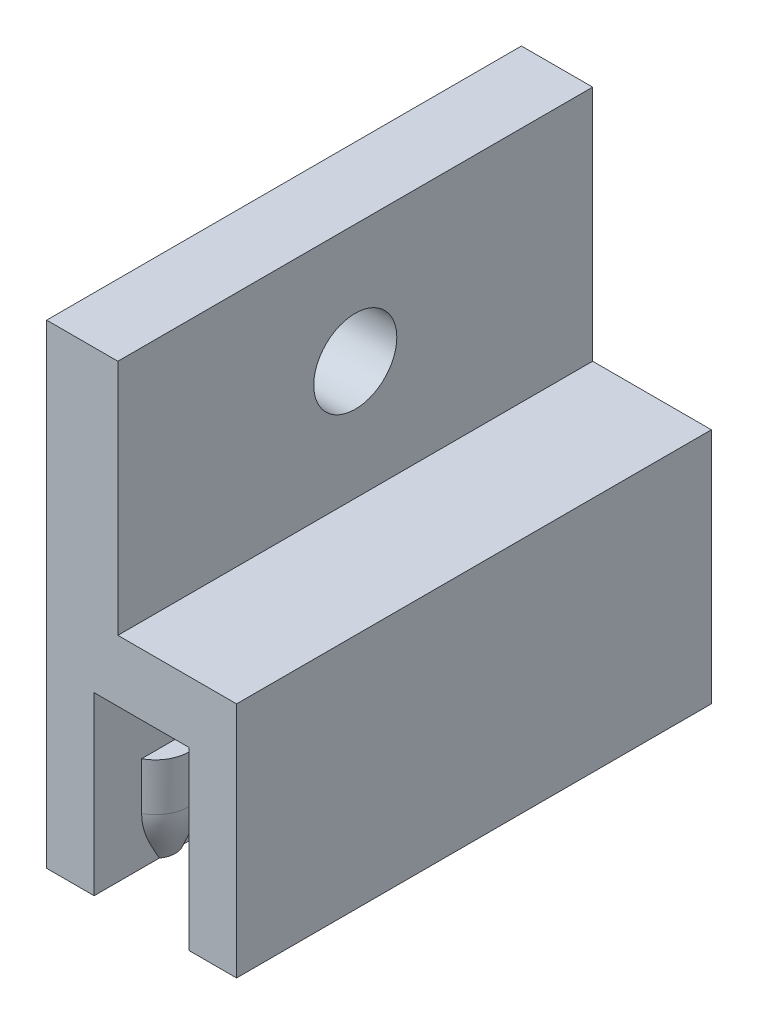
ISO-10303-21;
HEADER;
FILE_DESCRIPTION(('STEP AP214'),'2;1');
FILE_NAME('part.step','',(''),(''),'','','');
FILE_SCHEMA(('AUTOMOTIVE_DESIGN { 1 0 10303 214 1 1 1 1 }'));
ENDSEC;
DATA;
#1=APPLICATION_CONTEXT('core data for automotive mechanical design processes');
#2=APPLICATION_PROTOCOL_DEFINITION('international standard','automotive_design',2000,#1);
#3=PRODUCT_CONTEXT('',#1,'mechanical');
#4=PRODUCT('Part','Part','',(#3));
#5=PRODUCT_RELATED_PRODUCT_CATEGORY('part','',(#4));
#6=PRODUCT_DEFINITION_FORMATION('','',#4);
#7=PRODUCT_DEFINITION_CONTEXT('part definition',#1,'design');
#8=PRODUCT_DEFINITION('design','',#6,#7);
#9=PRODUCT_DEFINITION_SHAPE('','',#8);
#10=(LENGTH_UNIT() NAMED_UNIT(*) SI_UNIT(.MILLI.,.METRE.));
#11=(NAMED_UNIT(*) PLANE_ANGLE_UNIT() SI_UNIT($,.RADIAN.));
#12=(NAMED_UNIT(*) SI_UNIT($,.STERADIAN.) SOLID_ANGLE_UNIT());
#13=UNCERTAINTY_MEASURE_WITH_UNIT(LENGTH_MEASURE(1.E-05),#10,'distance_accuracy_value','');
#14=(GEOMETRIC_REPRESENTATION_CONTEXT(3) GLOBAL_UNCERTAINTY_ASSIGNED_CONTEXT((#13)) GLOBAL_UNIT_ASSIGNED_CONTEXT((#10,
#11,#12)) REPRESENTATION_CONTEXT('',''));
#15=CARTESIAN_POINT('',(0.,0.,0.));
#16=DIRECTION('',(0.,0.,1.));
#17=DIRECTION('',(1.,0.,0.));
#18=AXIS2_PLACEMENT_3D('',#15,#16,#17);
#19=CARTESIAN_POINT('',(0.,0.,20.));
#20=DIRECTION('',(-1.,0.,0.));
#21=DIRECTION('',(0.,0.,1.));
#22=AXIS2_PLACEMENT_3D('',#19,#20,#21);
#23=PLANE('',#22);
#24=DIRECTION('',(0.,1.,0.));
#25=VECTOR('',#24,1.);
#26=CARTESIAN_POINT('',(0.,0.,0.));
#27=LINE('',#26,#25);
#28=CARTESIAN_POINT('',(0.,0.,0.));
#29=VERTEX_POINT('',#28);
#30=CARTESIAN_POINT('',(0.,7.40971508067067,0.));
#31=VERTEX_POINT('',#30);
#32=EDGE_CURVE('E242',#29,#31,#27,.T.);
#33=ORIENTED_EDGE('',*,*,#32,.T.);
#34=CARTESIAN_POINT('',(0.,-77.,10.));
#35=DIRECTION('',(-1.,0.,0.));
#36=DIRECTION('',(0.,0.,1.));
#37=AXIS2_PLACEMENT_3D('',#34,#35,#36);
#38=CIRCLE('',#37,85.);
#39=CARTESIAN_POINT('',(0.,7.40971508067067,20.));
#40=VERTEX_POINT('',#39);
#41=EDGE_CURVE('E177',#40,#31,#38,.T.);
#42=ORIENTED_EDGE('',*,*,#41,.F.);
#43=DIRECTION('',(0.,1.,0.));
#44=VECTOR('',#43,1.);
#45=CARTESIAN_POINT('',(0.,0.,20.));
#46=LINE('',#45,#44);
#47=CARTESIAN_POINT('',(0.,0.,20.));
#48=VERTEX_POINT('',#47);
#49=EDGE_CURVE('E194',#48,#40,#46,.T.);
#50=ORIENTED_EDGE('',*,*,#49,.F.);
#51=DIRECTION('',(0.,0.,-1.));
#52=VECTOR('',#51,1.);
#53=CARTESIAN_POINT('',(0.,0.,20.));
#54=LINE('',#53,#52);
#55=CARTESIAN_POINT('',(0.,0.,17.25));
#56=VERTEX_POINT('',#55);
#57=EDGE_CURVE('E231',#48,#56,#54,.T.);
#58=ORIENTED_EDGE('',*,*,#57,.T.);
#59=CARTESIAN_POINT('',(0.,2.,18.));
#60=CARTESIAN_POINT('',(0.,1.28799968789021,18.));
#61=CARTESIAN_POINT('',(0.,0.643999843945103,17.625));
#62=CARTESIAN_POINT('',(0.,0.,17.25));
#63=B_SPLINE_CURVE_WITH_KNOTS('',3,(#59,#60,#61,#62),.UNSPECIFIED.,.F.,.F.,(4,4),(0.,1.),.UNSPECIFIED.);
#64=CARTESIAN_POINT('',(0.,2.,18.));
#65=VERTEX_POINT('',#64);
#66=EDGE_CURVE('E336',#65,#56,#63,.T.);
#67=ORIENTED_EDGE('',*,*,#66,.F.);
#68=DIRECTION('',(0.,-1.,0.));
#69=VECTOR('',#68,1.);
#70=CARTESIAN_POINT('',(0.,4.,18.));
#71=LINE('',#70,#69);
#72=CARTESIAN_POINT('',(0.,4.,18.));
#73=VERTEX_POINT('',#72);
#74=EDGE_CURVE('E253',#73,#65,#71,.T.);
#75=ORIENTED_EDGE('',*,*,#74,.F.);
#76=DIRECTION('',(0.,0.,-1.));
#77=VECTOR('',#76,1.);
#78=CARTESIAN_POINT('',(0.,4.,18.));
#79=LINE('',#78,#77);
#80=CARTESIAN_POINT('',(0.,4.,15.5));
#81=VERTEX_POINT('',#80);
#82=EDGE_CURVE('E257',#73,#81,#79,.T.);
#83=ORIENTED_EDGE('',*,*,#82,.T.);
#84=DIRECTION('',(0.,-1.,0.));
#85=VECTOR('',#84,1.);
#86=CARTESIAN_POINT('',(0.,4.,15.5));
#87=LINE('',#86,#85);
#88=CARTESIAN_POINT('',(0.,2.,15.5));
#89=VERTEX_POINT('',#88);
#90=EDGE_CURVE('E256',#81,#89,#87,.T.);
#91=ORIENTED_EDGE('',*,*,#90,.T.);
#92=CARTESIAN_POINT('',(0.,0.,16.25));
#93=CARTESIAN_POINT('',(0.,0.643999843945103,15.875));
#94=CARTESIAN_POINT('',(0.,1.28799968789021,15.5));
#95=CARTESIAN_POINT('',(0.,2.,15.5));
#96=B_SPLINE_CURVE_WITH_KNOTS('',3,(#92,#93,#94,#95),.UNSPECIFIED.,.F.,.F.,(4,4),(0.,1.),.UNSPECIFIED.);
#97=CARTESIAN_POINT('',(0.,0.,16.25));
#98=VERTEX_POINT('',#97);
#99=EDGE_CURVE('E338',#98,#89,#96,.T.);
#100=ORIENTED_EDGE('',*,*,#99,.F.);
#101=CARTESIAN_POINT('',(0.,0.,3.75));
#102=VERTEX_POINT('',#101);
#103=EDGE_CURVE('E226',#98,#102,#54,.T.);
#104=ORIENTED_EDGE('',*,*,#103,.T.);
#105=CARTESIAN_POINT('',(0.,2.,4.5));
#106=CARTESIAN_POINT('',(0.,1.28799968789021,4.5));
#107=CARTESIAN_POINT('',(0.,0.643999843945103,4.125));
#108=CARTESIAN_POINT('',(0.,0.,3.75));
#109=B_SPLINE_CURVE_WITH_KNOTS('',3,(#105,#106,#107,#108),.UNSPECIFIED.,.F.,.F.,(4,4),(0.,1.),.UNSPECIFIED.);
#110=CARTESIAN_POINT('',(0.,2.,4.5));
#111=VERTEX_POINT('',#110);
#112=EDGE_CURVE('E170',#111,#102,#109,.T.);
#113=ORIENTED_EDGE('',*,*,#112,.F.);
#114=DIRECTION('',(0.,-1.,0.));
#115=VECTOR('',#114,1.);
#116=CARTESIAN_POINT('',(0.,4.,4.5));
#117=LINE('',#116,#115);
#118=CARTESIAN_POINT('',(0.,4.,4.5));
#119=VERTEX_POINT('',#118);
#120=EDGE_CURVE('E405',#119,#111,#117,.T.);
#121=ORIENTED_EDGE('',*,*,#120,.F.);
#122=DIRECTION('',(0.,0.,-1.));
#123=VECTOR('',#122,1.);
#124=CARTESIAN_POINT('',(0.,4.,2.));
#125=LINE('',#124,#123);
#126=CARTESIAN_POINT('',(0.,4.,2.));
#127=VERTEX_POINT('',#126);
#128=EDGE_CURVE('E402',#119,#127,#125,.T.);
#129=ORIENTED_EDGE('',*,*,#128,.T.);
#130=DIRECTION('',(0.,-1.,0.));
#131=VECTOR('',#130,1.);
#132=CARTESIAN_POINT('',(0.,4.,2.));
#133=LINE('',#132,#131);
#134=CARTESIAN_POINT('',(0.,2.,2.));
#135=VERTEX_POINT('',#134);
#136=EDGE_CURVE('E500',#127,#135,#133,.T.);
#137=ORIENTED_EDGE('',*,*,#136,.T.);
#138=CARTESIAN_POINT('',(0.,0.,2.75));
#139=CARTESIAN_POINT('',(0.,0.643999843945103,2.375));
#140=CARTESIAN_POINT('',(0.,1.28799968789021,2.));
#141=CARTESIAN_POINT('',(0.,2.,2.));
#142=B_SPLINE_CURVE_WITH_KNOTS('',3,(#138,#139,#140,#141),.UNSPECIFIED.,.F.,.F.,(4,4),(0.,1.),.UNSPECIFIED.);
#143=CARTESIAN_POINT('',(0.,0.,2.75));
#144=VERTEX_POINT('',#143);
#145=EDGE_CURVE('E337',#144,#135,#142,.T.);
#146=ORIENTED_EDGE('',*,*,#145,.F.);
#147=EDGE_CURVE('E223',#144,#29,#54,.T.);
#148=ORIENTED_EDGE('',*,*,#147,.T.);
#149=EDGE_LOOP('',(#33,#42,#50,#58,#67,#75,#83,#91,#100,#104,#113,#121,#129,#137,#146,#148));
#150=FACE_BOUND('',#149,.T.);
#151=ADVANCED_FACE('F44',(#150),#23,.F.);
#152=CARTESIAN_POINT('',(4.,8.,20.));
#153=DIRECTION('',(1.,0.,0.));
#154=DIRECTION('',(0.,1.,0.));
#155=AXIS2_PLACEMENT_3D('',#152,#153,#154);
#156=PLANE('',#155);
#157=CARTESIAN_POINT('',(4.0000000000191,-77.,10.));
#158=DIRECTION('',(1.,0.,0.));
#159=DIRECTION('',(0.,1.,0.));
#160=AXIS2_PLACEMENT_3D('',#157,#158,#159);
#161=CIRCLE('',#160,85.);
#162=CARTESIAN_POINT('',(4.00000000013279,7.40971508067067,20.));
#163=VERTEX_POINT('',#162);
#164=CARTESIAN_POINT('',(4.00000000013279,7.40971508067067,0.));
#165=VERTEX_POINT('',#164);
#166=EDGE_CURVE('E162',#163,#165,#161,.F.);
#167=ORIENTED_EDGE('',*,*,#166,.T.);
#168=DIRECTION('',(0.,-1.,0.));
#169=VECTOR('',#168,1.);
#170=CARTESIAN_POINT('',(4.,8.,0.));
#171=LINE('',#170,#169);
#172=CARTESIAN_POINT('',(4.,0.,0.));
#173=VERTEX_POINT('',#172);
#174=EDGE_CURVE('E166',#165,#173,#171,.T.);
#175=ORIENTED_EDGE('',*,*,#174,.T.);
#176=DIRECTION('',(0.,0.,-1.));
#177=VECTOR('',#176,1.);
#178=CARTESIAN_POINT('',(4.,0.,20.));
#179=LINE('',#178,#177);
#180=CARTESIAN_POINT('',(4.,0.,20.));
#181=VERTEX_POINT('',#180);
#182=EDGE_CURVE('E12',#181,#173,#179,.T.);
#183=ORIENTED_EDGE('',*,*,#182,.F.);
#184=DIRECTION('',(0.,-1.,0.));
#185=VECTOR('',#184,1.);
#186=CARTESIAN_POINT('',(4.,8.,20.));
#187=LINE('',#186,#185);
#188=EDGE_CURVE('E167',#163,#181,#187,.T.);
#189=ORIENTED_EDGE('',*,*,#188,.F.);
#190=EDGE_LOOP('',(#167,#175,#183,#189));
#191=FACE_BOUND('',#190,.T.);
#192=ADVANCED_FACE('F46',(#191),#156,.F.);
#193=CARTESIAN_POINT('',(6.,0.,20.));
#194=DIRECTION('',(0.,-1.,0.));
#195=DIRECTION('',(0.,0.,-1.));
#196=AXIS2_PLACEMENT_3D('',#193,#194,#195);
#197=PLANE('',#196);
#198=DIRECTION('',(-1.,0.,0.));
#199=VECTOR('',#198,1.);
#200=CARTESIAN_POINT('',(6.,0.,0.));
#201=LINE('',#200,#199);
#202=CARTESIAN_POINT('',(6.,0.,0.));
#203=VERTEX_POINT('',#202);
#204=EDGE_CURVE('E186',#203,#173,#201,.T.);
#205=ORIENTED_EDGE('',*,*,#204,.F.);
#206=DIRECTION('',(0.,0.,-1.));
#207=VECTOR('',#206,1.);
#208=CARTESIAN_POINT('',(6.,0.,20.));
#209=LINE('',#208,#207);
#210=CARTESIAN_POINT('',(6.,0.,20.));
#211=VERTEX_POINT('',#210);
#212=EDGE_CURVE('E55',#211,#203,#209,.T.);
#213=ORIENTED_EDGE('',*,*,#212,.F.);
#214=DIRECTION('',(-1.,0.,0.));
#215=VECTOR('',#214,1.);
#216=CARTESIAN_POINT('',(6.,0.,20.));
#217=LINE('',#216,#215);
#218=EDGE_CURVE('E367',#211,#181,#217,.T.);
#219=ORIENTED_EDGE('',*,*,#218,.T.);
#220=ORIENTED_EDGE('',*,*,#182,.T.);
#221=EDGE_LOOP('',(#205,#213,#219,#220));
#222=FACE_BOUND('',#221,.T.);
#223=ADVANCED_FACE('F381',(#222),#197,.T.);
#224=CARTESIAN_POINT('',(6.,8.,20.));
#225=DIRECTION('',(1.,0.,0.));
#226=DIRECTION('',(0.,1.,0.));
#227=AXIS2_PLACEMENT_3D('',#224,#225,#226);
#228=PLANE('',#227);
#229=DIRECTION('',(0.,-1.,0.));
#230=VECTOR('',#229,1.);
#231=CARTESIAN_POINT('',(6.,8.,0.));
#232=LINE('',#231,#230);
#233=CARTESIAN_POINT('',(6.,10.,0.));
#234=VERTEX_POINT('',#233);
#235=EDGE_CURVE('E189',#234,#203,#232,.T.);
#236=ORIENTED_EDGE('',*,*,#235,.F.);
#237=DIRECTION('',(0.,0.,-1.));
#238=VECTOR('',#237,1.);
#239=CARTESIAN_POINT('',(6.,10.,20.));
#240=LINE('',#239,#238);
#241=CARTESIAN_POINT('',(6.,10.,20.));
#242=VERTEX_POINT('',#241);
#243=EDGE_CURVE('E378',#242,#234,#240,.T.);
#244=ORIENTED_EDGE('',*,*,#243,.F.);
#245=DIRECTION('',(0.,-1.,0.));
#246=VECTOR('',#245,1.);
#247=CARTESIAN_POINT('',(6.,8.,20.));
#248=LINE('',#247,#246);
#249=EDGE_CURVE('E210',#242,#211,#248,.T.);
#250=ORIENTED_EDGE('',*,*,#249,.T.);
#251=ORIENTED_EDGE('',*,*,#212,.T.);
#252=EDGE_LOOP('',(#236,#244,#250,#251));
#253=FACE_BOUND('',#252,.T.);
#254=ADVANCED_FACE('F376',(#253),#228,.T.);
#255=CARTESIAN_POINT('',(0.,10.,20.));
#256=DIRECTION('',(0.,1.,0.));
#257=DIRECTION('',(0.,0.,1.));
#258=AXIS2_PLACEMENT_3D('',#255,#256,#257);
#259=PLANE('',#258);
#260=DIRECTION('',(0.,0.,-1.));
#261=VECTOR('',#260,1.);
#262=CARTESIAN_POINT('',(1.,10.,20.));
#263=LINE('',#262,#261);
#264=CARTESIAN_POINT('',(1.,10.,20.));
#265=VERTEX_POINT('',#264);
#266=CARTESIAN_POINT('',(1.,10.,0.));
#267=VERTEX_POINT('',#266);
#268=EDGE_CURVE('E211',#265,#267,#263,.T.);
#269=ORIENTED_EDGE('',*,*,#268,.F.);
#270=DIRECTION('',(1.,0.,0.));
#271=VECTOR('',#270,1.);
#272=CARTESIAN_POINT('',(0.,10.,20.));
#273=LINE('',#272,#271);
#274=EDGE_CURVE('E206',#265,#242,#273,.T.);
#275=ORIENTED_EDGE('',*,*,#274,.T.);
#276=ORIENTED_EDGE('',*,*,#243,.T.);
#277=DIRECTION('',(1.,0.,0.));
#278=VECTOR('',#277,1.);
#279=CARTESIAN_POINT('',(0.,10.,0.));
#280=LINE('',#279,#278);
#281=EDGE_CURVE('E198',#267,#234,#280,.T.);
#282=ORIENTED_EDGE('',*,*,#281,.F.);
#283=EDGE_LOOP('',(#269,#275,#276,#282));
#284=FACE_BOUND('',#283,.T.);
#285=ADVANCED_FACE('F386',(#284),#259,.T.);
#286=CARTESIAN_POINT('',(-2.,0.,20.));
#287=DIRECTION('',(-1.,0.,0.));
#288=DIRECTION('',(0.,0.,1.));
#289=AXIS2_PLACEMENT_3D('',#286,#287,#288);
#290=PLANE('',#289);
#291=CARTESIAN_POINT('',(-2.,15.,10.));
#292=DIRECTION('',(1.,0.,0.));
#293=DIRECTION('',(0.,0.,-1.));
#294=AXIS2_PLACEMENT_3D('',#291,#292,#293);
#295=CIRCLE('',#294,1.75);
#296=CARTESIAN_POINT('',(-2.,15.,8.25));
#297=VERTEX_POINT('',#296);
#298=EDGE_CURVE('E391',#297,#297,#295,.T.);
#299=ORIENTED_EDGE('',*,*,#298,.T.);
#300=EDGE_LOOP('',(#299));
#301=FACE_BOUND('',#300,.T.);
#302=DIRECTION('',(0.,1.,0.));
#303=VECTOR('',#302,1.);
#304=CARTESIAN_POINT('',(-2.,0.,0.));
#305=LINE('',#304,#303);
#306=CARTESIAN_POINT('',(-2.,0.,0.));
#307=VERTEX_POINT('',#306);
#308=CARTESIAN_POINT('',(-2.,20.,0.));
#309=VERTEX_POINT('',#308);
#310=EDGE_CURVE('E201',#307,#309,#305,.T.);
#311=ORIENTED_EDGE('',*,*,#310,.F.);
#312=DIRECTION('',(0.,0.,-1.));
#313=VECTOR('',#312,1.);
#314=CARTESIAN_POINT('',(-2.,0.,20.));
#315=LINE('',#314,#313);
#316=CARTESIAN_POINT('',(-2.,0.,20.));
#317=VERTEX_POINT('',#316);
#318=EDGE_CURVE('E243',#317,#307,#315,.T.);
#319=ORIENTED_EDGE('',*,*,#318,.F.);
#320=DIRECTION('',(0.,1.,0.));
#321=VECTOR('',#320,1.);
#322=CARTESIAN_POINT('',(-2.,0.,20.));
#323=LINE('',#322,#321);
#324=CARTESIAN_POINT('',(-2.,20.,20.));
#325=VERTEX_POINT('',#324);
#326=EDGE_CURVE('E209',#317,#325,#323,.T.);
#327=ORIENTED_EDGE('',*,*,#326,.T.);
#328=DIRECTION('',(0.,0.,-1.));
#329=VECTOR('',#328,1.);
#330=CARTESIAN_POINT('',(-2.,20.,20.));
#331=LINE('',#330,#329);
#332=EDGE_CURVE('E191',#325,#309,#331,.T.);
#333=ORIENTED_EDGE('',*,*,#332,.T.);
#334=EDGE_LOOP('',(#311,#319,#327,#333));
#335=FACE_BOUND('',#334,.T.);
#336=ADVANCED_FACE('F358',(#301,#335),#290,.T.);
#337=CARTESIAN_POINT('',(0.,0.,20.));
#338=DIRECTION('',(0.,-1.,0.));
#339=DIRECTION('',(0.,0.,-1.));
#340=AXIS2_PLACEMENT_3D('',#337,#338,#339);
#341=PLANE('',#340);
#342=DIRECTION('',(-1.,0.,0.));
#343=VECTOR('',#342,1.);
#344=CARTESIAN_POINT('',(0.,0.,0.));
#345=LINE('',#344,#343);
#346=EDGE_CURVE('E388',#29,#307,#345,.T.);
#347=ORIENTED_EDGE('',*,*,#346,.F.);
#348=ORIENTED_EDGE('',*,*,#147,.F.);
#349=CARTESIAN_POINT('',(0.,0.,3.75));
#350=CARTESIAN_POINT('',(0.111076570808846,0.,3.60189790558821));
#351=CARTESIAN_POINT('',(0.166614856213268,0.,3.4259489527941));
#352=CARTESIAN_POINT('',(0.166614856213268,0.,3.0740510472059));
#353=CARTESIAN_POINT('',(0.111076570808846,0.,2.89810209441179));
#354=CARTESIAN_POINT('',(0.,0.,2.75));
#355=B_SPLINE_CURVE_WITH_KNOTS('',3,(#349,#350,#351,#352,#353,#354),.UNSPECIFIED.,.F.,.F.,(4,2,
4),(0.,0.5,1.),.UNSPECIFIED.);
#356=EDGE_CURVE('E63',#144,#102,#355,.F.);
#357=ORIENTED_EDGE('',*,*,#356,.T.);
#358=ORIENTED_EDGE('',*,*,#103,.F.);
#359=CARTESIAN_POINT('',(0.,0.,17.25));
#360=CARTESIAN_POINT('',(0.111076570808846,0.,17.1018979055882));
#361=CARTESIAN_POINT('',(0.166614856213268,0.,16.9259489527941));
#362=CARTESIAN_POINT('',(0.166614856213268,0.,16.5740510472059));
#363=CARTESIAN_POINT('',(0.111076570808846,0.,16.3981020944118));
#364=CARTESIAN_POINT('',(0.,0.,16.25));
#365=B_SPLINE_CURVE_WITH_KNOTS('',3,(#359,#360,#361,#362,#363,#364),.UNSPECIFIED.,.F.,.F.,(4,2,
4),(0.,0.5,1.),.UNSPECIFIED.);
#366=EDGE_CURVE('E72',#98,#56,#365,.F.);
#367=ORIENTED_EDGE('',*,*,#366,.T.);
#368=ORIENTED_EDGE('',*,*,#57,.F.);
#369=DIRECTION('',(-1.,0.,0.));
#370=VECTOR('',#369,1.);
#371=CARTESIAN_POINT('',(0.,0.,20.));
#372=LINE('',#371,#370);
#373=EDGE_CURVE('E218',#48,#317,#372,.T.);
#374=ORIENTED_EDGE('',*,*,#373,.T.);
#375=ORIENTED_EDGE('',*,*,#318,.T.);
#376=EDGE_LOOP('',(#347,#348,#357,#358,#367,#368,#374,#375));
#377=FACE_BOUND('',#376,.T.);
#378=ADVANCED_FACE('F297',(#377),#341,.T.);
#379=CARTESIAN_POINT('',(4.,0.,20.));
#380=DIRECTION('',(0.,0.,-1.));
#381=DIRECTION('',(-1.,0.,0.));
#382=AXIS2_PLACEMENT_3D('',#379,#380,#381);
#383=PLANE('',#382);
#384=DIRECTION('',(-1.,0.,0.));
#385=VECTOR('',#384,1.);
#386=CARTESIAN_POINT('',(500000.,7.40971508067067,20.));
#387=LINE('',#386,#385);
#388=EDGE_CURVE('E171',#163,#40,#387,.T.);
#389=ORIENTED_EDGE('',*,*,#388,.F.);
#390=ORIENTED_EDGE('',*,*,#188,.T.);
#391=ORIENTED_EDGE('',*,*,#218,.F.);
#392=ORIENTED_EDGE('',*,*,#249,.F.);
#393=ORIENTED_EDGE('',*,*,#274,.F.);
#394=DIRECTION('',(0.,1.,0.));
#395=VECTOR('',#394,1.);
#396=CARTESIAN_POINT('',(1.,10.,20.));
#397=LINE('',#396,#395);
#398=CARTESIAN_POINT('',(1.,20.,20.));
#399=VERTEX_POINT('',#398);
#400=EDGE_CURVE('E389',#265,#399,#397,.T.);
#401=ORIENTED_EDGE('',*,*,#400,.T.);
#402=DIRECTION('',(1.,0.,0.));
#403=VECTOR('',#402,1.);
#404=CARTESIAN_POINT('',(-2.,20.,20.));
#405=LINE('',#404,#403);
#406=EDGE_CURVE('E353',#325,#399,#405,.T.);
#407=ORIENTED_EDGE('',*,*,#406,.F.);
#408=ORIENTED_EDGE('',*,*,#326,.F.);
#409=ORIENTED_EDGE('',*,*,#373,.F.);
#410=ORIENTED_EDGE('',*,*,#49,.T.);
#411=EDGE_LOOP('',(#389,#390,#391,#392,#393,#401,#407,#408,#409,#410));
#412=FACE_BOUND('',#411,.T.);
#413=ADVANCED_FACE('F294',(#412),#383,.F.);
#414=CARTESIAN_POINT('',(4.,0.,0.));
#415=DIRECTION('',(0.,0.,-1.));
#416=DIRECTION('',(-1.,0.,0.));
#417=AXIS2_PLACEMENT_3D('',#414,#415,#416);
#418=PLANE('',#417);
#419=ORIENTED_EDGE('',*,*,#174,.F.);
#420=DIRECTION('',(-1.,0.,0.));
#421=VECTOR('',#420,1.);
#422=CARTESIAN_POINT('',(500000.,7.40971508067067,0.));
#423=LINE('',#422,#421);
#424=EDGE_CURVE('E174',#165,#31,#423,.T.);
#425=ORIENTED_EDGE('',*,*,#424,.T.);
#426=ORIENTED_EDGE('',*,*,#32,.F.);
#427=ORIENTED_EDGE('',*,*,#346,.T.);
#428=ORIENTED_EDGE('',*,*,#310,.T.);
#429=DIRECTION('',(1.,0.,0.));
#430=VECTOR('',#429,1.);
#431=CARTESIAN_POINT('',(-2.,20.,0.));
#432=LINE('',#431,#430);
#433=CARTESIAN_POINT('',(1.,20.,0.));
#434=VERTEX_POINT('',#433);
#435=EDGE_CURVE('E361',#309,#434,#432,.T.);
#436=ORIENTED_EDGE('',*,*,#435,.T.);
#437=DIRECTION('',(0.,1.,0.));
#438=VECTOR('',#437,1.);
#439=CARTESIAN_POINT('',(1.,10.,0.));
#440=LINE('',#439,#438);
#441=EDGE_CURVE('E384',#267,#434,#440,.T.);
#442=ORIENTED_EDGE('',*,*,#441,.F.);
#443=ORIENTED_EDGE('',*,*,#281,.T.);
#444=ORIENTED_EDGE('',*,*,#235,.T.);
#445=ORIENTED_EDGE('',*,*,#204,.T.);
#446=EDGE_LOOP('',(#419,#425,#426,#427,#428,#436,#442,#443,#444,#445));
#447=FACE_BOUND('',#446,.T.);
#448=ADVANCED_FACE('F183',(#447),#418,.T.);
#449=CARTESIAN_POINT('',(1.,10.,20.));
#450=DIRECTION('',(-1.,0.,0.));
#451=DIRECTION('',(0.,0.,1.));
#452=AXIS2_PLACEMENT_3D('',#449,#450,#451);
#453=PLANE('',#452);
#454=CARTESIAN_POINT('',(1.,15.,10.));
#455=DIRECTION('',(1.,0.,0.));
#456=DIRECTION('',(0.,0.,-1.));
#457=AXIS2_PLACEMENT_3D('',#454,#455,#456);
#458=CIRCLE('',#457,1.75);
#459=CARTESIAN_POINT('',(1.,15.,8.25));
#460=VERTEX_POINT('',#459);
#461=EDGE_CURVE('E262',#460,#460,#458,.T.);
#462=ORIENTED_EDGE('',*,*,#461,.F.);
#463=EDGE_LOOP('',(#462));
#464=FACE_BOUND('',#463,.T.);
#465=ORIENTED_EDGE('',*,*,#441,.T.);
#466=DIRECTION('',(0.,0.,-1.));
#467=VECTOR('',#466,1.);
#468=CARTESIAN_POINT('',(1.,20.,20.));
#469=LINE('',#468,#467);
#470=EDGE_CURVE('E187',#399,#434,#469,.T.);
#471=ORIENTED_EDGE('',*,*,#470,.F.);
#472=ORIENTED_EDGE('',*,*,#400,.F.);
#473=ORIENTED_EDGE('',*,*,#268,.T.);
#474=EDGE_LOOP('',(#465,#471,#472,#473));
#475=FACE_BOUND('',#474,.T.);
#476=ADVANCED_FACE('F289',(#464,#475),#453,.F.);
#477=CARTESIAN_POINT('',(-2.,20.,20.));
#478=DIRECTION('',(0.,1.,0.));
#479=DIRECTION('',(0.,0.,1.));
#480=AXIS2_PLACEMENT_3D('',#477,#478,#479);
#481=PLANE('',#480);
#482=ORIENTED_EDGE('',*,*,#435,.F.);
#483=ORIENTED_EDGE('',*,*,#332,.F.);
#484=ORIENTED_EDGE('',*,*,#406,.T.);
#485=ORIENTED_EDGE('',*,*,#470,.T.);
#486=EDGE_LOOP('',(#482,#483,#484,#485));
#487=FACE_BOUND('',#486,.T.);
#488=ADVANCED_FACE('F285',(#487),#481,.T.);
#489=CARTESIAN_POINT('',(-2.,15.,10.));
#490=DIRECTION('',(1.,0.,0.));
#491=DIRECTION('',(0.,0.,-1.));
#492=AXIS2_PLACEMENT_3D('',#489,#490,#491);
#493=CYLINDRICAL_SURFACE('',#492,1.75);
#494=ORIENTED_EDGE('',*,*,#298,.F.);
#495=EDGE_LOOP('',(#494));
#496=FACE_BOUND('',#495,.T.);
#497=ORIENTED_EDGE('',*,*,#461,.T.);
#498=EDGE_LOOP('',(#497));
#499=FACE_BOUND('',#498,.T.);
#500=ADVANCED_FACE('F280',(#496,#499),#493,.F.);
#501=CARTESIAN_POINT('',(-0.666666666666666,4.,16.75));
#502=DIRECTION('',(0.,-1.,0.));
#503=DIRECTION('',(0.,0.,-1.));
#504=AXIS2_PLACEMENT_3D('',#501,#502,#503);
#505=CYLINDRICAL_SURFACE('',#504,1.41666666666667);
#506=CARTESIAN_POINT('',(0.,2.,15.5));
#507=CARTESIAN_POINT('',(0.461566259649048,2.,15.7461686718128));
#508=CARTESIAN_POINT('',(0.75,2.,16.2268915723977));
#509=CARTESIAN_POINT('',(0.750000000000001,2.,17.2731084276023));
#510=CARTESIAN_POINT('',(0.461566259649049,2.,17.7538313281872));
#511=CARTESIAN_POINT('',(0.,2.,18.));
#512=B_SPLINE_CURVE_WITH_KNOTS('',3,(#506,#507,#508,#509,#510,#511),.UNSPECIFIED.,.F.,.F.,(4,2,
4),(0.,0.5,1.),.UNSPECIFIED.);
#513=EDGE_CURVE('E345',#89,#65,#512,.T.);
#514=ORIENTED_EDGE('',*,*,#513,.F.);
#515=ORIENTED_EDGE('',*,*,#90,.F.);
#516=CARTESIAN_POINT('',(-0.666666666666666,4.,16.75));
#517=DIRECTION('',(0.,-1.,0.));
#518=DIRECTION('',(0.,0.,1.));
#519=AXIS2_PLACEMENT_3D('',#516,#517,#518);
#520=CIRCLE('',#519,1.41666666666667);
#521=EDGE_CURVE('E399',#81,#73,#520,.T.);
#522=ORIENTED_EDGE('',*,*,#521,.T.);
#523=ORIENTED_EDGE('',*,*,#74,.T.);
#524=EDGE_LOOP('',(#514,#515,#522,#523));
#525=FACE_BOUND('',#524,.T.);
#526=ADVANCED_FACE('F269',(#525),#505,.T.);
#527=CARTESIAN_POINT('',(-0.666666666666666,4.,16.75));
#528=DIRECTION('',(0.,1.,0.));
#529=DIRECTION('',(0.,0.,1.));
#530=AXIS2_PLACEMENT_3D('',#527,#528,#529);
#531=PLANE('',#530);
#532=ORIENTED_EDGE('',*,*,#521,.F.);
#533=ORIENTED_EDGE('',*,*,#82,.F.);
#534=EDGE_LOOP('',(#532,#533));
#535=FACE_BOUND('',#534,.T.);
#536=ADVANCED_FACE('F279',(#535),#531,.T.);
#537=CARTESIAN_POINT('',(-0.666666666666666,4.,3.25));
#538=DIRECTION('',(0.,-1.,0.));
#539=DIRECTION('',(0.,0.,-1.));
#540=AXIS2_PLACEMENT_3D('',#537,#538,#539);
#541=CYLINDRICAL_SURFACE('',#540,1.41666666666667);
#542=CARTESIAN_POINT('',(0.,2.,2.));
#543=CARTESIAN_POINT('',(0.461566259649048,2.,2.24616867181282));
#544=CARTESIAN_POINT('',(0.75,2.,2.72689157239774));
#545=CARTESIAN_POINT('',(0.750000000000001,2.,3.77310842760225));
#546=CARTESIAN_POINT('',(0.461566259649049,2.,4.25383132818717));
#547=CARTESIAN_POINT('',(0.,2.,4.5));
#548=B_SPLINE_CURVE_WITH_KNOTS('',3,(#542,#543,#544,#545,#546,#547),.UNSPECIFIED.,.F.,.F.,(4,2,
4),(0.,0.5,1.),.UNSPECIFIED.);
#549=EDGE_CURVE('E341',#135,#111,#548,.T.);
#550=ORIENTED_EDGE('',*,*,#549,.F.);
#551=ORIENTED_EDGE('',*,*,#136,.F.);
#552=CARTESIAN_POINT('',(-0.666666666666666,4.,3.25));
#553=DIRECTION('',(0.,-1.,0.));
#554=DIRECTION('',(0.,0.,-1.));
#555=AXIS2_PLACEMENT_3D('',#552,#553,#554);
#556=CIRCLE('',#555,1.41666666666667);
#557=EDGE_CURVE('E406',#127,#119,#556,.T.);
#558=ORIENTED_EDGE('',*,*,#557,.T.);
#559=ORIENTED_EDGE('',*,*,#120,.T.);
#560=EDGE_LOOP('',(#550,#551,#558,#559));
#561=FACE_BOUND('',#560,.T.);
#562=ADVANCED_FACE('F499',(#561),#541,.T.);
#563=CARTESIAN_POINT('',(-0.666666666666666,4.,3.25));
#564=DIRECTION('',(0.,-1.,0.));
#565=DIRECTION('',(0.,0.,-1.));
#566=AXIS2_PLACEMENT_3D('',#563,#564,#565);
#567=PLANE('',#566);
#568=ORIENTED_EDGE('',*,*,#557,.F.);
#569=ORIENTED_EDGE('',*,*,#128,.F.);
#570=EDGE_LOOP('',(#568,#569));
#571=FACE_BOUND('',#570,.T.);
#572=ADVANCED_FACE('F422',(#571),#567,.F.);
#573=CARTESIAN_POINT('',(0.,0.,17.25));
#574=CARTESIAN_POINT('',(0.,0.643999843945103,17.625));
#575=CARTESIAN_POINT('',(0.,1.28799968789021,18.));
#576=CARTESIAN_POINT('',(0.,2.,18.));
#577=CARTESIAN_POINT('',(0.111076570808846,0.,17.1018979055882));
#578=CARTESIAN_POINT('',(0.286321415228947,0.648387601901384,17.4278646168877));
#579=CARTESIAN_POINT('',(0.461566259649049,1.29677520380277,17.7538313281872));
#580=CARTESIAN_POINT('',(0.461566259649049,2.,17.7538313281872));
#581=CARTESIAN_POINT('',(0.166614856213268,0.,16.9259489527941));
#582=CARTESIAN_POINT('',(0.458307428106635,0.652775359857665,17.0995286901982));
#583=CARTESIAN_POINT('',(0.750000000000001,1.30555071971533,17.2731084276023));
#584=CARTESIAN_POINT('',(0.750000000000001,2.,17.2731084276023));
#585=CARTESIAN_POINT('',(0.166614856213268,0.,16.5740510472059));
#586=CARTESIAN_POINT('',(0.458307428106634,0.652775359857665,16.4004713098018));
#587=CARTESIAN_POINT('',(0.75,1.30555071971533,16.2268915723977));
#588=CARTESIAN_POINT('',(0.75,2.,16.2268915723977));
#589=CARTESIAN_POINT('',(0.111076570808846,0.,16.3981020944118));
#590=CARTESIAN_POINT('',(0.286321415228947,0.648387601901384,16.0721353831123));
#591=CARTESIAN_POINT('',(0.461566259649048,1.29677520380277,15.7461686718128));
#592=CARTESIAN_POINT('',(0.461566259649048,2.,15.7461686718128));
#593=CARTESIAN_POINT('',(0.,0.,16.25));
#594=CARTESIAN_POINT('',(0.,0.643999843945103,15.875));
#595=CARTESIAN_POINT('',(0.,1.28799968789021,15.5));
#596=CARTESIAN_POINT('',(0.,2.,15.5));
#597=B_SPLINE_SURFACE_WITH_KNOTS('',3,3,((#573,#574,#575,#576),(#577,#578,#579,#580),(#581,#582,
#583,#584),(#585,#586,#587,#588),(#589,#590,#591,#592),(#593,#594,#595,#596)),.UNSPECIFIED.,.F.,
.F.,.F.,(4,2,4),(4,4),(0.,0.5,1.),(0.,1.),.UNSPECIFIED.);
#598=ORIENTED_EDGE('',*,*,#366,.F.);
#599=ORIENTED_EDGE('',*,*,#99,.T.);
#600=ORIENTED_EDGE('',*,*,#513,.T.);
#601=ORIENTED_EDGE('',*,*,#66,.T.);
#602=EDGE_LOOP('',(#598,#599,#600,#601));
#603=FACE_BOUND('',#602,.T.);
#604=ADVANCED_FACE('F344',(#603),#597,.T.);
#605=CARTESIAN_POINT('',(0.,0.,3.75));
#606=CARTESIAN_POINT('',(0.,0.643999843945103,4.125));
#607=CARTESIAN_POINT('',(0.,1.28799968789021,4.5));
#608=CARTESIAN_POINT('',(0.,2.,4.5));
#609=CARTESIAN_POINT('',(0.111076570808846,0.,3.60189790558821));
#610=CARTESIAN_POINT('',(0.286321415228947,0.648387601901384,3.92786461688769));
#611=CARTESIAN_POINT('',(0.461566259649049,1.29677520380277,4.25383132818717));
#612=CARTESIAN_POINT('',(0.461566259649049,2.,4.25383132818717));
#613=CARTESIAN_POINT('',(0.166614856213268,0.,3.4259489527941));
#614=CARTESIAN_POINT('',(0.458307428106635,0.652775359857665,3.59952869019818));
#615=CARTESIAN_POINT('',(0.750000000000001,1.30555071971533,3.77310842760225));
#616=CARTESIAN_POINT('',(0.750000000000001,2.,3.77310842760225));
#617=CARTESIAN_POINT('',(0.166614856213268,0.,3.0740510472059));
#618=CARTESIAN_POINT('',(0.458307428106634,0.652775359857665,2.90047130980182));
#619=CARTESIAN_POINT('',(0.75,1.30555071971533,2.72689157239774));
#620=CARTESIAN_POINT('',(0.75,2.,2.72689157239774));
#621=CARTESIAN_POINT('',(0.111076570808846,0.,2.89810209441179));
#622=CARTESIAN_POINT('',(0.286321415228947,0.648387601901384,2.57213538311231));
#623=CARTESIAN_POINT('',(0.461566259649048,1.29677520380277,2.24616867181282));
#624=CARTESIAN_POINT('',(0.461566259649048,2.,2.24616867181282));
#625=CARTESIAN_POINT('',(0.,0.,2.75));
#626=CARTESIAN_POINT('',(0.,0.643999843945103,2.375));
#627=CARTESIAN_POINT('',(0.,1.28799968789021,2.));
#628=CARTESIAN_POINT('',(0.,2.,2.));
#629=B_SPLINE_SURFACE_WITH_KNOTS('',3,3,((#605,#606,#607,#608),(#609,#610,#611,#612),(#613,#614,
#615,#616),(#617,#618,#619,#620),(#621,#622,#623,#624),(#625,#626,#627,#628)),.UNSPECIFIED.,.F.,
.F.,.F.,(4,2,4),(4,4),(0.,0.5,1.),(0.,1.),.UNSPECIFIED.);
#630=ORIENTED_EDGE('',*,*,#356,.F.);
#631=ORIENTED_EDGE('',*,*,#145,.T.);
#632=ORIENTED_EDGE('',*,*,#549,.T.);
#633=ORIENTED_EDGE('',*,*,#112,.T.);
#634=EDGE_LOOP('',(#630,#631,#632,#633));
#635=FACE_BOUND('',#634,.T.);
#636=ADVANCED_FACE('F421',(#635),#629,.T.);
#637=CARTESIAN_POINT('',(500000.,-77.,10.));
#638=DIRECTION('',(-1.,0.,0.));
#639=DIRECTION('',(0.,0.,1.));
#640=AXIS2_PLACEMENT_3D('',#637,#638,#639);
#641=CYLINDRICAL_SURFACE('',#640,85.);
#642=ORIENTED_EDGE('',*,*,#166,.F.);
#643=ORIENTED_EDGE('',*,*,#388,.T.);
#644=ORIENTED_EDGE('',*,*,#41,.T.);
#645=ORIENTED_EDGE('',*,*,#424,.F.);
#646=EDGE_LOOP('',(#642,#643,#644,#645));
#647=FACE_BOUND('',#646,.T.);
#648=ADVANCED_FACE('F175',(#647),#641,.F.);
#649=CLOSED_SHELL('',(#151,#192,#223,#254,#285,#336,#378,#413,#448,#476,#488,#500,#526,#536,
#562,#572,#604,#636,#648));
#650=MANIFOLD_SOLID_BREP('B2',#649);
#651=ADVANCED_BREP_SHAPE_REPRESENTATION('',(#18,#650),#14);
#652=SHAPE_DEFINITION_REPRESENTATION(#9,#651);
ENDSEC;
END-ISO-10303-21;
